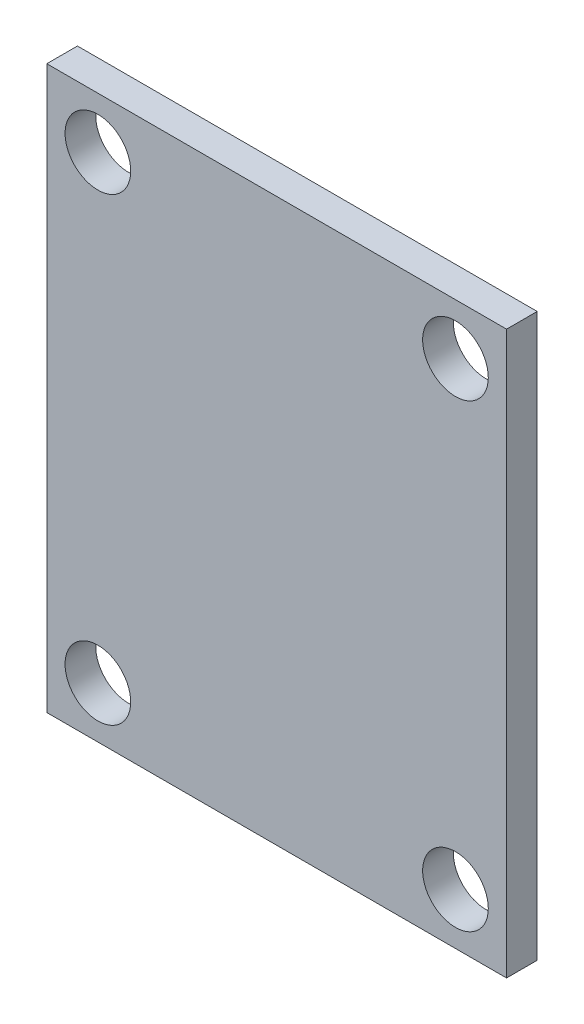
ISO-10303-21;
HEADER;
FILE_DESCRIPTION(('STEP AP214'),'2;1');
FILE_NAME('part.step','',(''),(''),'','','');
FILE_SCHEMA(('AUTOMOTIVE_DESIGN { 1 0 10303 214 1 1 1 1 }'));
ENDSEC;
DATA;
#1=APPLICATION_CONTEXT('core data for automotive mechanical design processes');
#2=APPLICATION_PROTOCOL_DEFINITION('international standard','automotive_design',2000,#1);
#3=PRODUCT_CONTEXT('',#1,'mechanical');
#4=PRODUCT('Part','Part','',(#3));
#5=PRODUCT_RELATED_PRODUCT_CATEGORY('part','',(#4));
#6=PRODUCT_DEFINITION_FORMATION('','',#4);
#7=PRODUCT_DEFINITION_CONTEXT('part definition',#1,'design');
#8=PRODUCT_DEFINITION('design','',#6,#7);
#9=PRODUCT_DEFINITION_SHAPE('','',#8);
#10=(LENGTH_UNIT() NAMED_UNIT(*) SI_UNIT(.MILLI.,.METRE.));
#11=(NAMED_UNIT(*) PLANE_ANGLE_UNIT() SI_UNIT($,.RADIAN.));
#12=(NAMED_UNIT(*) SI_UNIT($,.STERADIAN.) SOLID_ANGLE_UNIT());
#13=UNCERTAINTY_MEASURE_WITH_UNIT(LENGTH_MEASURE(1.E-05),#10,'distance_accuracy_value','');
#14=(GEOMETRIC_REPRESENTATION_CONTEXT(3) GLOBAL_UNCERTAINTY_ASSIGNED_CONTEXT((#13)) GLOBAL_UNIT_ASSIGNED_CONTEXT((#10,
#11,#12)) REPRESENTATION_CONTEXT('',''));
#15=CARTESIAN_POINT('',(0.,0.,0.));
#16=DIRECTION('',(0.,0.,1.));
#17=DIRECTION('',(1.,0.,0.));
#18=AXIS2_PLACEMENT_3D('',#15,#16,#17);
#19=CARTESIAN_POINT('',(11.43,-13.97,1.524));
#20=DIRECTION('',(0.,0.,1.));
#21=DIRECTION('',(1.,0.,0.));
#22=AXIS2_PLACEMENT_3D('',#19,#20,#21);
#23=PLANE('',#22);
#24=CARTESIAN_POINT('',(8.89,-11.43,1.524));
#25=DIRECTION('',(0.,0.,1.));
#26=DIRECTION('',(1.,0.,0.));
#27=AXIS2_PLACEMENT_3D('',#24,#25,#26);
#28=CIRCLE('',#27,1.63195);
#29=CARTESIAN_POINT('',(10.52195,-11.43,1.524));
#30=VERTEX_POINT('',#29);
#31=EDGE_CURVE('E120',#30,#30,#28,.T.);
#32=ORIENTED_EDGE('',*,*,#31,.F.);
#33=EDGE_LOOP('',(#32));
#34=FACE_BOUND('',#33,.T.);
#35=CARTESIAN_POINT('',(-8.89,11.43,1.524));
#36=DIRECTION('',(0.,0.,1.));
#37=DIRECTION('',(1.,0.,0.));
#38=AXIS2_PLACEMENT_3D('',#35,#36,#37);
#39=CIRCLE('',#38,1.63195);
#40=CARTESIAN_POINT('',(-7.25805,11.43,1.524));
#41=VERTEX_POINT('',#40);
#42=EDGE_CURVE('E99',#41,#41,#39,.T.);
#43=ORIENTED_EDGE('',*,*,#42,.F.);
#44=EDGE_LOOP('',(#43));
#45=FACE_BOUND('',#44,.T.);
#46=DIRECTION('',(0.,1.,0.));
#47=VECTOR('',#46,1.);
#48=CARTESIAN_POINT('',(11.43,13.97,1.524));
#49=LINE('',#48,#47);
#50=CARTESIAN_POINT('',(11.43,-13.97,1.524));
#51=VERTEX_POINT('',#50);
#52=CARTESIAN_POINT('',(11.43,13.97,1.524));
#53=VERTEX_POINT('',#52);
#54=EDGE_CURVE('E84',#51,#53,#49,.T.);
#55=ORIENTED_EDGE('',*,*,#54,.T.);
#56=DIRECTION('',(-1.,0.,0.));
#57=VECTOR('',#56,1.);
#58=CARTESIAN_POINT('',(-11.43,13.97,1.524));
#59=LINE('',#58,#57);
#60=CARTESIAN_POINT('',(-11.43,13.97,1.524));
#61=VERTEX_POINT('',#60);
#62=EDGE_CURVE('E79',#53,#61,#59,.T.);
#63=ORIENTED_EDGE('',*,*,#62,.T.);
#64=DIRECTION('',(0.,-1.,0.));
#65=VECTOR('',#64,1.);
#66=CARTESIAN_POINT('',(-11.43,13.97,1.524));
#67=LINE('',#66,#65);
#68=CARTESIAN_POINT('',(-11.43,-13.97,1.524));
#69=VERTEX_POINT('',#68);
#70=EDGE_CURVE('E82',#61,#69,#67,.T.);
#71=ORIENTED_EDGE('',*,*,#70,.T.);
#72=DIRECTION('',(1.,0.,0.));
#73=VECTOR('',#72,1.);
#74=CARTESIAN_POINT('',(-11.43,-13.97,1.524));
#75=LINE('',#74,#73);
#76=EDGE_CURVE('E49',#69,#51,#75,.T.);
#77=ORIENTED_EDGE('',*,*,#76,.T.);
#78=EDGE_LOOP('',(#55,#63,#71,#77));
#79=FACE_BOUND('',#78,.T.);
#80=CARTESIAN_POINT('',(8.89,11.43,1.524));
#81=DIRECTION('',(0.,0.,1.));
#82=DIRECTION('',(1.,0.,0.));
#83=AXIS2_PLACEMENT_3D('',#80,#81,#82);
#84=CIRCLE('',#83,1.63195);
#85=CARTESIAN_POINT('',(10.52195,11.43,1.524));
#86=VERTEX_POINT('',#85);
#87=EDGE_CURVE('E114',#86,#86,#84,.T.);
#88=ORIENTED_EDGE('',*,*,#87,.F.);
#89=EDGE_LOOP('',(#88));
#90=FACE_BOUND('',#89,.T.);
#91=CARTESIAN_POINT('',(-8.89,-11.43,1.524));
#92=DIRECTION('',(0.,0.,1.));
#93=DIRECTION('',(1.,0.,0.));
#94=AXIS2_PLACEMENT_3D('',#91,#92,#93);
#95=CIRCLE('',#94,1.63195);
#96=CARTESIAN_POINT('',(-7.25805,-11.43,1.524));
#97=VERTEX_POINT('',#96);
#98=EDGE_CURVE('E126',#97,#97,#95,.T.);
#99=ORIENTED_EDGE('',*,*,#98,.F.);
#100=EDGE_LOOP('',(#99));
#101=FACE_BOUND('',#100,.T.);
#102=ADVANCED_FACE('F32',(#34,#45,#79,#90,#101),#23,.T.);
#103=CARTESIAN_POINT('',(11.43,-13.97,0.));
#104=DIRECTION('',(0.,0.,1.));
#105=DIRECTION('',(1.,0.,0.));
#106=AXIS2_PLACEMENT_3D('',#103,#104,#105);
#107=PLANE('',#106);
#108=CARTESIAN_POINT('',(8.89,-11.43,0.));
#109=DIRECTION('',(0.,0.,1.));
#110=DIRECTION('',(1.,0.,0.));
#111=AXIS2_PLACEMENT_3D('',#108,#109,#110);
#112=CIRCLE('',#111,1.63195);
#113=CARTESIAN_POINT('',(10.52195,-11.43,0.));
#114=VERTEX_POINT('',#113);
#115=EDGE_CURVE('E123',#114,#114,#112,.T.);
#116=ORIENTED_EDGE('',*,*,#115,.T.);
#117=EDGE_LOOP('',(#116));
#118=FACE_BOUND('',#117,.T.);
#119=CARTESIAN_POINT('',(-8.89,11.43,0.));
#120=DIRECTION('',(0.,0.,1.));
#121=DIRECTION('',(1.,0.,0.));
#122=AXIS2_PLACEMENT_3D('',#119,#120,#121);
#123=CIRCLE('',#122,1.63195);
#124=CARTESIAN_POINT('',(-7.25805,11.43,0.));
#125=VERTEX_POINT('',#124);
#126=EDGE_CURVE('E111',#125,#125,#123,.T.);
#127=ORIENTED_EDGE('',*,*,#126,.T.);
#128=EDGE_LOOP('',(#127));
#129=FACE_BOUND('',#128,.T.);
#130=DIRECTION('',(0.,1.,0.));
#131=VECTOR('',#130,1.);
#132=CARTESIAN_POINT('',(11.43,13.97,0.));
#133=LINE('',#132,#131);
#134=CARTESIAN_POINT('',(11.43,-13.97,0.));
#135=VERTEX_POINT('',#134);
#136=CARTESIAN_POINT('',(11.43,13.97,0.));
#137=VERTEX_POINT('',#136);
#138=EDGE_CURVE('E96',#135,#137,#133,.T.);
#139=ORIENTED_EDGE('',*,*,#138,.F.);
#140=DIRECTION('',(1.,0.,0.));
#141=VECTOR('',#140,1.);
#142=CARTESIAN_POINT('',(-11.43,-13.97,0.));
#143=LINE('',#142,#141);
#144=CARTESIAN_POINT('',(-11.43,-13.97,0.));
#145=VERTEX_POINT('',#144);
#146=EDGE_CURVE('E72',#145,#135,#143,.T.);
#147=ORIENTED_EDGE('',*,*,#146,.F.);
#148=DIRECTION('',(0.,-1.,0.));
#149=VECTOR('',#148,1.);
#150=CARTESIAN_POINT('',(-11.43,13.97,0.));
#151=LINE('',#150,#149);
#152=CARTESIAN_POINT('',(-11.43,13.97,0.));
#153=VERTEX_POINT('',#152);
#154=EDGE_CURVE('E66',#153,#145,#151,.T.);
#155=ORIENTED_EDGE('',*,*,#154,.F.);
#156=DIRECTION('',(-1.,0.,0.));
#157=VECTOR('',#156,1.);
#158=CARTESIAN_POINT('',(-11.43,13.97,0.));
#159=LINE('',#158,#157);
#160=EDGE_CURVE('E88',#137,#153,#159,.T.);
#161=ORIENTED_EDGE('',*,*,#160,.F.);
#162=EDGE_LOOP('',(#139,#147,#155,#161));
#163=FACE_BOUND('',#162,.T.);
#164=CARTESIAN_POINT('',(8.89,11.43,0.));
#165=DIRECTION('',(0.,0.,1.));
#166=DIRECTION('',(1.,0.,0.));
#167=AXIS2_PLACEMENT_3D('',#164,#165,#166);
#168=CIRCLE('',#167,1.63195);
#169=CARTESIAN_POINT('',(10.52195,11.43,0.));
#170=VERTEX_POINT('',#169);
#171=EDGE_CURVE('E117',#170,#170,#168,.T.);
#172=ORIENTED_EDGE('',*,*,#171,.T.);
#173=EDGE_LOOP('',(#172));
#174=FACE_BOUND('',#173,.T.);
#175=CARTESIAN_POINT('',(-8.89,-11.43,0.));
#176=DIRECTION('',(0.,0.,1.));
#177=DIRECTION('',(1.,0.,0.));
#178=AXIS2_PLACEMENT_3D('',#175,#176,#177);
#179=CIRCLE('',#178,1.63195);
#180=CARTESIAN_POINT('',(-7.25805,-11.43,0.));
#181=VERTEX_POINT('',#180);
#182=EDGE_CURVE('E129',#181,#181,#179,.T.);
#183=ORIENTED_EDGE('',*,*,#182,.T.);
#184=EDGE_LOOP('',(#183));
#185=FACE_BOUND('',#184,.T.);
#186=ADVANCED_FACE('F107',(#118,#129,#163,#174,#185),#107,.F.);
#187=CARTESIAN_POINT('',(11.43,13.97,1.524));
#188=DIRECTION('',(-1.,0.,0.));
#189=DIRECTION('',(0.,-1.,0.));
#190=AXIS2_PLACEMENT_3D('',#187,#188,#189);
#191=PLANE('',#190);
#192=ORIENTED_EDGE('',*,*,#138,.T.);
#193=DIRECTION('',(0.,0.,-1.));
#194=VECTOR('',#193,1.);
#195=CARTESIAN_POINT('',(11.43,13.97,1.524));
#196=LINE('',#195,#194);
#197=EDGE_CURVE('E11',#53,#137,#196,.T.);
#198=ORIENTED_EDGE('',*,*,#197,.F.);
#199=ORIENTED_EDGE('',*,*,#54,.F.);
#200=DIRECTION('',(0.,0.,-1.));
#201=VECTOR('',#200,1.);
#202=CARTESIAN_POINT('',(11.43,-13.97,1.524));
#203=LINE('',#202,#201);
#204=EDGE_CURVE('E92',#51,#135,#203,.T.);
#205=ORIENTED_EDGE('',*,*,#204,.T.);
#206=EDGE_LOOP('',(#192,#198,#199,#205));
#207=FACE_BOUND('',#206,.T.);
#208=ADVANCED_FACE('F34',(#207),#191,.F.);
#209=CARTESIAN_POINT('',(-11.43,13.97,1.524));
#210=DIRECTION('',(0.,-1.,0.));
#211=DIRECTION('',(0.,0.,-1.));
#212=AXIS2_PLACEMENT_3D('',#209,#210,#211);
#213=PLANE('',#212);
#214=ORIENTED_EDGE('',*,*,#160,.T.);
#215=DIRECTION('',(0.,0.,-1.));
#216=VECTOR('',#215,1.);
#217=CARTESIAN_POINT('',(-11.43,13.97,1.524));
#218=LINE('',#217,#216);
#219=EDGE_CURVE('E41',#61,#153,#218,.T.);
#220=ORIENTED_EDGE('',*,*,#219,.F.);
#221=ORIENTED_EDGE('',*,*,#62,.F.);
#222=ORIENTED_EDGE('',*,*,#197,.T.);
#223=EDGE_LOOP('',(#214,#220,#221,#222));
#224=FACE_BOUND('',#223,.T.);
#225=ADVANCED_FACE('F87',(#224),#213,.F.);
#226=CARTESIAN_POINT('',(-11.43,13.97,1.524));
#227=DIRECTION('',(1.,0.,0.));
#228=DIRECTION('',(0.,0.,-1.));
#229=AXIS2_PLACEMENT_3D('',#226,#227,#228);
#230=PLANE('',#229);
#231=ORIENTED_EDGE('',*,*,#154,.T.);
#232=DIRECTION('',(0.,0.,-1.));
#233=VECTOR('',#232,1.);
#234=CARTESIAN_POINT('',(-11.43,-13.97,1.524));
#235=LINE('',#234,#233);
#236=EDGE_CURVE('E89',#69,#145,#235,.T.);
#237=ORIENTED_EDGE('',*,*,#236,.F.);
#238=ORIENTED_EDGE('',*,*,#70,.F.);
#239=ORIENTED_EDGE('',*,*,#219,.T.);
#240=EDGE_LOOP('',(#231,#237,#238,#239));
#241=FACE_BOUND('',#240,.T.);
#242=ADVANCED_FACE('F90',(#241),#230,.F.);
#243=CARTESIAN_POINT('',(-11.43,-13.97,1.524));
#244=DIRECTION('',(0.,1.,0.));
#245=DIRECTION('',(0.,0.,1.));
#246=AXIS2_PLACEMENT_3D('',#243,#244,#245);
#247=PLANE('',#246);
#248=ORIENTED_EDGE('',*,*,#146,.T.);
#249=ORIENTED_EDGE('',*,*,#204,.F.);
#250=ORIENTED_EDGE('',*,*,#76,.F.);
#251=ORIENTED_EDGE('',*,*,#236,.T.);
#252=EDGE_LOOP('',(#248,#249,#250,#251));
#253=FACE_BOUND('',#252,.T.);
#254=ADVANCED_FACE('F104',(#253),#247,.F.);
#255=CARTESIAN_POINT('',(-8.89,11.43,1.524));
#256=DIRECTION('',(0.,0.,-1.));
#257=DIRECTION('',(-1.,0.,0.));
#258=AXIS2_PLACEMENT_3D('',#255,#256,#257);
#259=CYLINDRICAL_SURFACE('',#258,1.63195);
#260=ORIENTED_EDGE('',*,*,#42,.T.);
#261=EDGE_LOOP('',(#260));
#262=FACE_BOUND('',#261,.T.);
#263=ORIENTED_EDGE('',*,*,#126,.F.);
#264=EDGE_LOOP('',(#263));
#265=FACE_BOUND('',#264,.T.);
#266=ADVANCED_FACE('F149',(#262,#265),#259,.F.);
#267=CARTESIAN_POINT('',(8.89,11.43,1.524));
#268=DIRECTION('',(0.,0.,-1.));
#269=DIRECTION('',(-1.,0.,0.));
#270=AXIS2_PLACEMENT_3D('',#267,#268,#269);
#271=CYLINDRICAL_SURFACE('',#270,1.63195);
#272=ORIENTED_EDGE('',*,*,#87,.T.);
#273=EDGE_LOOP('',(#272));
#274=FACE_BOUND('',#273,.T.);
#275=ORIENTED_EDGE('',*,*,#171,.F.);
#276=EDGE_LOOP('',(#275));
#277=FACE_BOUND('',#276,.T.);
#278=ADVANCED_FACE('F195',(#274,#277),#271,.F.);
#279=CARTESIAN_POINT('',(8.89,-11.43,1.524));
#280=DIRECTION('',(0.,0.,-1.));
#281=DIRECTION('',(-1.,0.,0.));
#282=AXIS2_PLACEMENT_3D('',#279,#280,#281);
#283=CYLINDRICAL_SURFACE('',#282,1.63195);
#284=ORIENTED_EDGE('',*,*,#31,.T.);
#285=EDGE_LOOP('',(#284));
#286=FACE_BOUND('',#285,.T.);
#287=ORIENTED_EDGE('',*,*,#115,.F.);
#288=EDGE_LOOP('',(#287));
#289=FACE_BOUND('',#288,.T.);
#290=ADVANCED_FACE('F203',(#286,#289),#283,.F.);
#291=CARTESIAN_POINT('',(-8.89,-11.43,1.524));
#292=DIRECTION('',(0.,0.,-1.));
#293=DIRECTION('',(-1.,0.,0.));
#294=AXIS2_PLACEMENT_3D('',#291,#292,#293);
#295=CYLINDRICAL_SURFACE('',#294,1.63195);
#296=ORIENTED_EDGE('',*,*,#98,.T.);
#297=EDGE_LOOP('',(#296));
#298=FACE_BOUND('',#297,.T.);
#299=ORIENTED_EDGE('',*,*,#182,.F.);
#300=EDGE_LOOP('',(#299));
#301=FACE_BOUND('',#300,.T.);
#302=ADVANCED_FACE('F135',(#298,#301),#295,.F.);
#303=CLOSED_SHELL('',(#102,#186,#208,#225,#242,#254,#266,#278,#290,#302));
#304=MANIFOLD_SOLID_BREP('B2',#303);
#305=ADVANCED_BREP_SHAPE_REPRESENTATION('',(#18,#304),#14);
#306=SHAPE_DEFINITION_REPRESENTATION(#9,#305);
ENDSEC;
END-ISO-10303-21;
